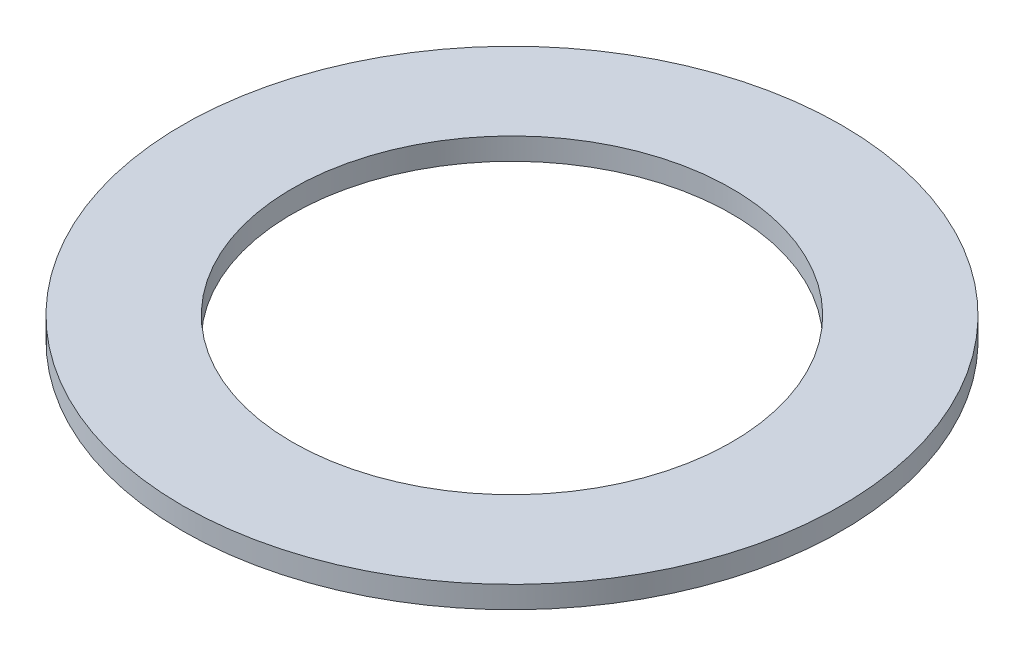
ISO-10303-21;
HEADER;
FILE_DESCRIPTION(('STEP AP214'),'2;1');
FILE_NAME('part.step','',(''),(''),'','','');
FILE_SCHEMA(('AUTOMOTIVE_DESIGN { 1 0 10303 214 1 1 1 1 }'));
ENDSEC;
DATA;
#1=APPLICATION_CONTEXT('core data for automotive mechanical design processes');
#2=APPLICATION_PROTOCOL_DEFINITION('international standard','automotive_design',2000,#1);
#3=PRODUCT_CONTEXT('',#1,'mechanical');
#4=PRODUCT('Part','Part','',(#3));
#5=PRODUCT_RELATED_PRODUCT_CATEGORY('part','',(#4));
#6=PRODUCT_DEFINITION_FORMATION('','',#4);
#7=PRODUCT_DEFINITION_CONTEXT('part definition',#1,'design');
#8=PRODUCT_DEFINITION('design','',#6,#7);
#9=PRODUCT_DEFINITION_SHAPE('','',#8);
#10=(LENGTH_UNIT() NAMED_UNIT(*) SI_UNIT(.MILLI.,.METRE.));
#11=(NAMED_UNIT(*) PLANE_ANGLE_UNIT() SI_UNIT($,.RADIAN.));
#12=(NAMED_UNIT(*) SI_UNIT($,.STERADIAN.) SOLID_ANGLE_UNIT());
#13=UNCERTAINTY_MEASURE_WITH_UNIT(LENGTH_MEASURE(1.E-05),#10,'distance_accuracy_value','');
#14=(GEOMETRIC_REPRESENTATION_CONTEXT(3) GLOBAL_UNCERTAINTY_ASSIGNED_CONTEXT((#13)) GLOBAL_UNIT_ASSIGNED_CONTEXT((#10,
#11,#12)) REPRESENTATION_CONTEXT('',''));
#15=CARTESIAN_POINT('',(0.,0.,0.));
#16=DIRECTION('',(0.,0.,1.));
#17=DIRECTION('',(1.,0.,0.));
#18=AXIS2_PLACEMENT_3D('',#15,#16,#17);
#19=CARTESIAN_POINT('',(0.,5.,0.));
#20=DIRECTION('',(0.,-1.,0.));
#21=DIRECTION('',(0.,0.,-1.));
#22=AXIS2_PLACEMENT_3D('',#19,#20,#21);
#23=CYLINDRICAL_SURFACE('',#22,75.);
#24=CARTESIAN_POINT('',(0.,5.,0.));
#25=DIRECTION('',(0.,1.,0.));
#26=DIRECTION('',(0.,0.,1.));
#27=AXIS2_PLACEMENT_3D('',#24,#25,#26);
#28=CIRCLE('',#27,75.);
#29=CARTESIAN_POINT('',(0.,5.,75.));
#30=VERTEX_POINT('',#29);
#31=EDGE_CURVE('E10',#30,#30,#28,.T.);
#32=ORIENTED_EDGE('',*,*,#31,.F.);
#33=EDGE_LOOP('',(#32));
#34=FACE_BOUND('',#33,.T.);
#35=CARTESIAN_POINT('',(0.,0.,0.));
#36=DIRECTION('',(0.,1.,0.));
#37=DIRECTION('',(0.,0.,1.));
#38=AXIS2_PLACEMENT_3D('',#35,#36,#37);
#39=CIRCLE('',#38,75.);
#40=CARTESIAN_POINT('',(0.,0.,75.));
#41=VERTEX_POINT('',#40);
#42=EDGE_CURVE('E37',#41,#41,#39,.T.);
#43=ORIENTED_EDGE('',*,*,#42,.T.);
#44=EDGE_LOOP('',(#43));
#45=FACE_BOUND('',#44,.T.);
#46=ADVANCED_FACE('F40',(#34,#45),#23,.T.);
#47=CARTESIAN_POINT('',(0.,5.,0.));
#48=DIRECTION('',(0.,1.,0.));
#49=DIRECTION('',(0.,0.,1.));
#50=AXIS2_PLACEMENT_3D('',#47,#48,#49);
#51=PLANE('',#50);
#52=CARTESIAN_POINT('',(0.,5.,0.));
#53=DIRECTION('',(0.,1.,0.));
#54=DIRECTION('',(0.,0.,1.));
#55=AXIS2_PLACEMENT_3D('',#52,#53,#54);
#56=CIRCLE('',#55,50.);
#57=CARTESIAN_POINT('',(0.,5.,50.));
#58=VERTEX_POINT('',#57);
#59=EDGE_CURVE('E50',#58,#58,#56,.T.);
#60=ORIENTED_EDGE('',*,*,#59,.F.);
#61=EDGE_LOOP('',(#60));
#62=FACE_BOUND('',#61,.T.);
#63=ORIENTED_EDGE('',*,*,#31,.T.);
#64=EDGE_LOOP('',(#63));
#65=FACE_BOUND('',#64,.T.);
#66=ADVANCED_FACE('F59',(#62,#65),#51,.T.);
#67=CARTESIAN_POINT('',(0.,0.,0.));
#68=DIRECTION('',(0.,1.,0.));
#69=DIRECTION('',(0.,0.,1.));
#70=AXIS2_PLACEMENT_3D('',#67,#68,#69);
#71=PLANE('',#70);
#72=CARTESIAN_POINT('',(0.,0.,0.));
#73=DIRECTION('',(0.,1.,0.));
#74=DIRECTION('',(0.,0.,1.));
#75=AXIS2_PLACEMENT_3D('',#72,#73,#74);
#76=CIRCLE('',#75,50.);
#77=CARTESIAN_POINT('',(0.,0.,50.));
#78=VERTEX_POINT('',#77);
#79=EDGE_CURVE('E47',#78,#78,#76,.T.);
#80=ORIENTED_EDGE('',*,*,#79,.T.);
#81=EDGE_LOOP('',(#80));
#82=FACE_BOUND('',#81,.T.);
#83=ORIENTED_EDGE('',*,*,#42,.F.);
#84=EDGE_LOOP('',(#83));
#85=FACE_BOUND('',#84,.T.);
#86=ADVANCED_FACE('F58',(#82,#85),#71,.F.);
#87=CARTESIAN_POINT('',(0.,5.,0.));
#88=DIRECTION('',(0.,-1.,0.));
#89=DIRECTION('',(0.,0.,-1.));
#90=AXIS2_PLACEMENT_3D('',#87,#88,#89);
#91=CYLINDRICAL_SURFACE('',#90,50.);
#92=ORIENTED_EDGE('',*,*,#59,.T.);
#93=EDGE_LOOP('',(#92));
#94=FACE_BOUND('',#93,.T.);
#95=ORIENTED_EDGE('',*,*,#79,.F.);
#96=EDGE_LOOP('',(#95));
#97=FACE_BOUND('',#96,.T.);
#98=ADVANCED_FACE('F54',(#94,#97),#91,.F.);
#99=CLOSED_SHELL('',(#46,#66,#86,#98));
#100=MANIFOLD_SOLID_BREP('B2',#99);
#101=ADVANCED_BREP_SHAPE_REPRESENTATION('',(#18,#100),#14);
#102=SHAPE_DEFINITION_REPRESENTATION(#9,#101);
ENDSEC;
END-ISO-10303-21;
